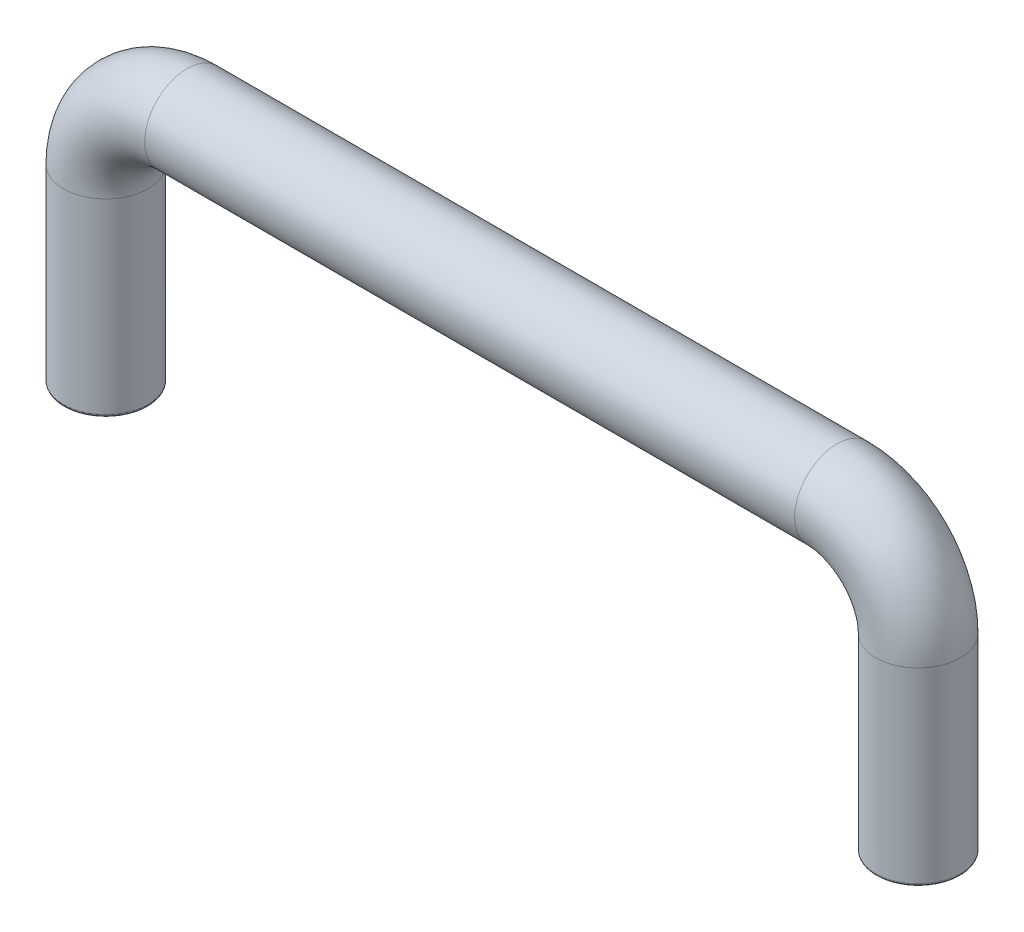
ISO-10303-21;
HEADER;
FILE_DESCRIPTION(('STEP AP214'),'2;1');
FILE_NAME('part.step','',(''),(''),'','','');
FILE_SCHEMA(('AUTOMOTIVE_DESIGN { 1 0 10303 214 1 1 1 1 }'));
ENDSEC;
DATA;
#1=APPLICATION_CONTEXT('core data for automotive mechanical design processes');
#2=APPLICATION_PROTOCOL_DEFINITION('international standard','automotive_design',2000,#1);
#3=PRODUCT_CONTEXT('',#1,'mechanical');
#4=PRODUCT('Part','Part','',(#3));
#5=PRODUCT_RELATED_PRODUCT_CATEGORY('part','',(#4));
#6=PRODUCT_DEFINITION_FORMATION('','',#4);
#7=PRODUCT_DEFINITION_CONTEXT('part definition',#1,'design');
#8=PRODUCT_DEFINITION('design','',#6,#7);
#9=PRODUCT_DEFINITION_SHAPE('','',#8);
#10=(LENGTH_UNIT() NAMED_UNIT(*) SI_UNIT(.MILLI.,.METRE.));
#11=(NAMED_UNIT(*) PLANE_ANGLE_UNIT() SI_UNIT($,.RADIAN.));
#12=(NAMED_UNIT(*) SI_UNIT($,.STERADIAN.) SOLID_ANGLE_UNIT());
#13=UNCERTAINTY_MEASURE_WITH_UNIT(LENGTH_MEASURE(1.E-05),#10,'distance_accuracy_value','');
#14=(GEOMETRIC_REPRESENTATION_CONTEXT(3) GLOBAL_UNCERTAINTY_ASSIGNED_CONTEXT((#13)) GLOBAL_UNIT_ASSIGNED_CONTEXT((#10,
#11,#12)) REPRESENTATION_CONTEXT('',''));
#15=CARTESIAN_POINT('',(0.,0.,0.));
#16=DIRECTION('',(0.,0.,1.));
#17=DIRECTION('',(1.,0.,0.));
#18=AXIS2_PLACEMENT_3D('',#15,#16,#17);
#19=CARTESIAN_POINT('',(76.2,0.,0.));
#20=DIRECTION('',(0.,1.,0.));
#21=DIRECTION('',(0.,0.,1.));
#22=AXIS2_PLACEMENT_3D('',#19,#20,#21);
#23=PLANE('',#22);
#24=CARTESIAN_POINT('',(76.2,0.,0.));
#25=DIRECTION('',(0.,1.,0.));
#26=DIRECTION('',(0.,0.,1.));
#27=AXIS2_PLACEMENT_3D('',#24,#25,#26);
#28=CIRCLE('',#27,1.98119999999999);
#29=CARTESIAN_POINT('',(76.2,0.,1.98119999999999));
#30=VERTEX_POINT('',#29);
#31=EDGE_CURVE('E92',#30,#30,#28,.T.);
#32=ORIENTED_EDGE('',*,*,#31,.T.);
#33=EDGE_LOOP('',(#32));
#34=FACE_BOUND('',#33,.T.);
#35=CARTESIAN_POINT('',(76.2,0.,0.));
#36=DIRECTION('',(0.,1.,0.));
#37=DIRECTION('',(0.,0.,1.));
#38=AXIS2_PLACEMENT_3D('',#35,#36,#37);
#39=CIRCLE('',#38,3.71475);
#40=CARTESIAN_POINT('',(76.2,0.,3.71475));
#41=VERTEX_POINT('',#40);
#42=EDGE_CURVE('E89',#41,#41,#39,.F.);
#43=ORIENTED_EDGE('',*,*,#42,.T.);
#44=EDGE_LOOP('',(#43));
#45=FACE_BOUND('',#44,.T.);
#46=ADVANCED_FACE('F36',(#34,#45),#23,.F.);
#47=CARTESIAN_POINT('',(0.,0.,0.));
#48=DIRECTION('',(0.,-1.,0.));
#49=DIRECTION('',(0.,0.,1.));
#50=AXIS2_PLACEMENT_3D('',#47,#48,#49);
#51=PLANE('',#50);
#52=CARTESIAN_POINT('',(0.,0.,0.));
#53=DIRECTION('',(0.,-1.,0.));
#54=DIRECTION('',(0.,0.,-1.));
#55=AXIS2_PLACEMENT_3D('',#52,#53,#54);
#56=CIRCLE('',#55,1.98119999999999);
#57=CARTESIAN_POINT('',(0.,0.,-1.98119999999999));
#58=VERTEX_POINT('',#57);
#59=EDGE_CURVE('E83',#58,#58,#56,.F.);
#60=ORIENTED_EDGE('',*,*,#59,.T.);
#61=EDGE_LOOP('',(#60));
#62=FACE_BOUND('',#61,.T.);
#63=CARTESIAN_POINT('',(0.,0.,0.));
#64=DIRECTION('',(0.,-1.,0.));
#65=DIRECTION('',(0.,0.,-1.));
#66=AXIS2_PLACEMENT_3D('',#63,#64,#65);
#67=CIRCLE('',#66,3.71475);
#68=CARTESIAN_POINT('',(0.,0.,-3.71475));
#69=VERTEX_POINT('',#68);
#70=EDGE_CURVE('E80',#69,#69,#67,.T.);
#71=ORIENTED_EDGE('',*,*,#70,.T.);
#72=EDGE_LOOP('',(#71));
#73=FACE_BOUND('',#72,.T.);
#74=ADVANCED_FACE('F114',(#62,#73),#51,.T.);
#75=CARTESIAN_POINT('',(0.,0.,0.));
#76=DIRECTION('',(0.,1.,0.));
#77=DIRECTION('',(0.,0.,1.));
#78=AXIS2_PLACEMENT_3D('',#75,#76,#77);
#79=CYLINDRICAL_SURFACE('',#78,3.96875);
#80=CARTESIAN_POINT('',(0.,0.254,0.));
#81=DIRECTION('',(0.,-1.,0.));
#82=DIRECTION('',(0.,0.,-1.));
#83=AXIS2_PLACEMENT_3D('',#80,#81,#82);
#84=CIRCLE('',#83,3.96875);
#85=CARTESIAN_POINT('',(0.,0.254,-3.96875));
#86=VERTEX_POINT('',#85);
#87=EDGE_CURVE('E11',#86,#86,#84,.F.);
#88=ORIENTED_EDGE('',*,*,#87,.T.);
#89=EDGE_LOOP('',(#88));
#90=FACE_BOUND('',#89,.T.);
#91=CARTESIAN_POINT('',(0.,17.78,0.));
#92=DIRECTION('',(0.,-1.,0.));
#93=DIRECTION('',(0.,0.,1.));
#94=AXIS2_PLACEMENT_3D('',#91,#92,#93);
#95=CIRCLE('',#94,3.96875);
#96=CARTESIAN_POINT('',(-3.96874999999996,17.78,0.));
#97=VERTEX_POINT('',#96);
#98=EDGE_CURVE('E63',#97,#97,#95,.T.);
#99=ORIENTED_EDGE('',*,*,#98,.T.);
#100=EDGE_LOOP('',(#99));
#101=FACE_BOUND('',#100,.T.);
#102=ADVANCED_FACE('F120',(#90,#101),#79,.T.);
#103=CARTESIAN_POINT('',(7.62,17.78,0.));
#104=DIRECTION('',(0.,0.,-1.));
#105=DIRECTION('',(-1.,0.,0.));
#106=AXIS2_PLACEMENT_3D('',#103,#104,#105);
#107=TOROIDAL_SURFACE('',#106,7.61999999999996,3.96875);
#108=CARTESIAN_POINT('',(7.62,25.4,0.));
#109=DIRECTION('',(-1.,0.,0.));
#110=DIRECTION('',(0.,0.,1.));
#111=AXIS2_PLACEMENT_3D('',#108,#109,#110);
#112=CIRCLE('',#111,3.96875);
#113=CARTESIAN_POINT('',(7.62,29.36875,0.));
#114=VERTEX_POINT('',#113);
#115=EDGE_CURVE('E68',#114,#114,#112,.T.);
#116=CARTESIAN_POINT('',(7.62,17.78,0.));
#117=DIRECTION('',(0.,0.,-1.));
#118=DIRECTION('',(-1.,0.,0.));
#119=AXIS2_PLACEMENT_3D('',#116,#117,#118);
#120=CIRCLE('',#119,11.58875);
#121=EDGE_CURVE('',#97,#114,#120,.T.);
#122=ORIENTED_EDGE('',*,*,#98,.F.);
#123=ORIENTED_EDGE('',*,*,#115,.T.);
#124=ORIENTED_EDGE('',*,*,#121,.T.);
#125=ORIENTED_EDGE('',*,*,#121,.F.);
#126=EDGE_LOOP('',(#122,#124,#123,#125));
#127=FACE_BOUND('',#126,.T.);
#128=ADVANCED_FACE('F139',(#127),#107,.T.);
#129=CARTESIAN_POINT('',(7.62,25.4,0.));
#130=DIRECTION('',(1.,0.,0.));
#131=DIRECTION('',(0.,1.,0.));
#132=AXIS2_PLACEMENT_3D('',#129,#130,#131);
#133=CYLINDRICAL_SURFACE('',#132,3.96875);
#134=CARTESIAN_POINT('',(68.58,25.4,0.));
#135=DIRECTION('',(-1.,0.,0.));
#136=DIRECTION('',(0.,0.,1.));
#137=AXIS2_PLACEMENT_3D('',#134,#135,#136);
#138=CIRCLE('',#137,3.96875);
#139=CARTESIAN_POINT('',(68.58,29.36875,0.));
#140=VERTEX_POINT('',#139);
#141=EDGE_CURVE('E71',#140,#140,#138,.T.);
#142=ORIENTED_EDGE('',*,*,#141,.T.);
#143=EDGE_LOOP('',(#142));
#144=FACE_BOUND('',#143,.T.);
#145=ORIENTED_EDGE('',*,*,#115,.F.);
#146=EDGE_LOOP('',(#145));
#147=FACE_BOUND('',#146,.T.);
#148=ADVANCED_FACE('F133',(#144,#147),#133,.T.);
#149=CARTESIAN_POINT('',(68.58,17.78,0.));
#150=DIRECTION('',(0.,0.,-1.));
#151=DIRECTION('',(-1.,0.,0.));
#152=AXIS2_PLACEMENT_3D('',#149,#150,#151);
#153=TOROIDAL_SURFACE('',#152,7.61999999999996,3.96875);
#154=CARTESIAN_POINT('',(76.2,17.78,0.));
#155=DIRECTION('',(0.,1.,0.));
#156=DIRECTION('',(0.,0.,1.));
#157=AXIS2_PLACEMENT_3D('',#154,#155,#156);
#158=CIRCLE('',#157,3.96875);
#159=CARTESIAN_POINT('',(80.16875,17.78,0.));
#160=VERTEX_POINT('',#159);
#161=EDGE_CURVE('E74',#160,#160,#158,.T.);
#162=CARTESIAN_POINT('',(68.58,17.78,0.));
#163=DIRECTION('',(0.,0.,-1.));
#164=DIRECTION('',(-1.,0.,0.));
#165=AXIS2_PLACEMENT_3D('',#162,#163,#164);
#166=CIRCLE('',#165,11.58875);
#167=EDGE_CURVE('',#140,#160,#166,.T.);
#168=ORIENTED_EDGE('',*,*,#141,.F.);
#169=ORIENTED_EDGE('',*,*,#161,.T.);
#170=ORIENTED_EDGE('',*,*,#167,.T.);
#171=ORIENTED_EDGE('',*,*,#167,.F.);
#172=EDGE_LOOP('',(#168,#170,#169,#171));
#173=FACE_BOUND('',#172,.T.);
#174=ADVANCED_FACE('F127',(#173),#153,.T.);
#175=CARTESIAN_POINT('',(76.2,17.78,0.));
#176=DIRECTION('',(0.,-1.,0.));
#177=DIRECTION('',(0.,0.,-1.));
#178=AXIS2_PLACEMENT_3D('',#175,#176,#177);
#179=CYLINDRICAL_SURFACE('',#178,3.96875);
#180=CARTESIAN_POINT('',(76.2,0.254000000000001,0.));
#181=DIRECTION('',(0.,1.,0.));
#182=DIRECTION('',(0.,0.,1.));
#183=AXIS2_PLACEMENT_3D('',#180,#181,#182);
#184=CIRCLE('',#183,3.96875);
#185=CARTESIAN_POINT('',(76.2,0.254000000000001,3.96875));
#186=VERTEX_POINT('',#185);
#187=EDGE_CURVE('E44',#186,#186,#184,.T.);
#188=ORIENTED_EDGE('',*,*,#187,.T.);
#189=EDGE_LOOP('',(#188));
#190=FACE_BOUND('',#189,.T.);
#191=ORIENTED_EDGE('',*,*,#161,.F.);
#192=EDGE_LOOP('',(#191));
#193=FACE_BOUND('',#192,.T.);
#194=ADVANCED_FACE('F97',(#190,#193),#179,.T.);
#195=CARTESIAN_POINT('',(0.,7.96924999999996,0.));
#196=DIRECTION('',(0.,-1.,0.));
#197=DIRECTION('',(0.,0.,-1.));
#198=AXIS2_PLACEMENT_3D('',#195,#196,#197);
#199=CONICAL_SURFACE('',#198,1.7272,1.02974425867665);
#200=CARTESIAN_POINT('',(0.,9.00705646118436,0.));
#201=VERTEX_POINT('',#200);
#202=VERTEX_LOOP('',#201);
#203=FACE_BOUND('',#202,.T.);
#204=CARTESIAN_POINT('',(0.,7.96924999999996,0.));
#205=DIRECTION('',(0.,-1.,0.));
#206=DIRECTION('',(0.,0.,-1.));
#207=AXIS2_PLACEMENT_3D('',#204,#205,#206);
#208=CIRCLE('',#207,1.7272);
#209=CARTESIAN_POINT('',(0.,7.96924999999996,-1.7272));
#210=VERTEX_POINT('',#209);
#211=EDGE_CURVE('E60',#210,#210,#208,.T.);
#212=ORIENTED_EDGE('',*,*,#211,.T.);
#213=EDGE_LOOP('',(#212));
#214=FACE_BOUND('',#213,.T.);
#215=ADVANCED_FACE('F123',(#203,#214),#199,.F.);
#216=CARTESIAN_POINT('',(0.,0.,0.));
#217=DIRECTION('',(0.,-1.,0.));
#218=DIRECTION('',(0.,0.,-1.));
#219=AXIS2_PLACEMENT_3D('',#216,#217,#218);
#220=CYLINDRICAL_SURFACE('',#219,1.72719999999999);
#221=CARTESIAN_POINT('',(0.,0.254,0.));
#222=DIRECTION('',(0.,-1.,0.));
#223=DIRECTION('',(0.,0.,-1.));
#224=AXIS2_PLACEMENT_3D('',#221,#222,#223);
#225=CIRCLE('',#224,1.72719999999999);
#226=CARTESIAN_POINT('',(0.,0.254,-1.72719999999999));
#227=VERTEX_POINT('',#226);
#228=EDGE_CURVE('E77',#227,#227,#225,.T.);
#229=ORIENTED_EDGE('',*,*,#228,.T.);
#230=EDGE_LOOP('',(#229));
#231=FACE_BOUND('',#230,.T.);
#232=ORIENTED_EDGE('',*,*,#211,.F.);
#233=EDGE_LOOP('',(#232));
#234=FACE_BOUND('',#233,.T.);
#235=ADVANCED_FACE('F54',(#231,#234),#220,.F.);
#236=CARTESIAN_POINT('',(76.2,7.96924999999996,0.));
#237=DIRECTION('',(0.,-1.,0.));
#238=DIRECTION('',(0.,0.,-1.));
#239=AXIS2_PLACEMENT_3D('',#236,#237,#238);
#240=CONICAL_SURFACE('',#239,1.7272,1.02974425867665);
#241=CARTESIAN_POINT('',(76.2,9.00705646118436,0.));
#242=VERTEX_POINT('',#241);
#243=VERTEX_LOOP('',#242);
#244=FACE_BOUND('',#243,.T.);
#245=CARTESIAN_POINT('',(76.2,7.96924999999996,0.));
#246=DIRECTION('',(0.,-1.,0.));
#247=DIRECTION('',(0.,0.,-1.));
#248=AXIS2_PLACEMENT_3D('',#245,#246,#247);
#249=CIRCLE('',#248,1.7272);
#250=CARTESIAN_POINT('',(76.2,7.96924999999996,-1.7272));
#251=VERTEX_POINT('',#250);
#252=EDGE_CURVE('E58',#251,#251,#249,.T.);
#253=ORIENTED_EDGE('',*,*,#252,.T.);
#254=EDGE_LOOP('',(#253));
#255=FACE_BOUND('',#254,.T.);
#256=ADVANCED_FACE('F50',(#244,#255),#240,.F.);
#257=CARTESIAN_POINT('',(76.2,0.,0.));
#258=DIRECTION('',(0.,-1.,0.));
#259=DIRECTION('',(0.,0.,-1.));
#260=AXIS2_PLACEMENT_3D('',#257,#258,#259);
#261=CYLINDRICAL_SURFACE('',#260,1.72719999999999);
#262=CARTESIAN_POINT('',(76.2,0.254,0.));
#263=DIRECTION('',(0.,1.,0.));
#264=DIRECTION('',(0.,0.,1.));
#265=AXIS2_PLACEMENT_3D('',#262,#263,#264);
#266=CIRCLE('',#265,1.72719999999999);
#267=CARTESIAN_POINT('',(76.2,0.254,1.72719999999999));
#268=VERTEX_POINT('',#267);
#269=EDGE_CURVE('E86',#268,#268,#266,.F.);
#270=ORIENTED_EDGE('',*,*,#269,.T.);
#271=EDGE_LOOP('',(#270));
#272=FACE_BOUND('',#271,.T.);
#273=ORIENTED_EDGE('',*,*,#252,.F.);
#274=EDGE_LOOP('',(#273));
#275=FACE_BOUND('',#274,.T.);
#276=ADVANCED_FACE('F53',(#272,#275),#261,.F.);
#277=CARTESIAN_POINT('',(0.,0.254,0.));
#278=DIRECTION('',(0.,-1.,0.));
#279=DIRECTION('',(0.,0.,-1.));
#280=AXIS2_PLACEMENT_3D('',#277,#278,#279);
#281=TOROIDAL_SURFACE('',#280,1.98119999999999,0.254);
#282=ORIENTED_EDGE('',*,*,#59,.F.);
#283=EDGE_LOOP('',(#282));
#284=FACE_BOUND('',#283,.T.);
#285=ORIENTED_EDGE('',*,*,#228,.F.);
#286=EDGE_LOOP('',(#285));
#287=FACE_BOUND('',#286,.T.);
#288=ADVANCED_FACE('F109',(#284,#287),#281,.T.);
#289=CARTESIAN_POINT('',(76.2,0.254,0.));
#290=DIRECTION('',(0.,1.,0.));
#291=DIRECTION('',(0.,0.,1.));
#292=AXIS2_PLACEMENT_3D('',#289,#290,#291);
#293=TOROIDAL_SURFACE('',#292,1.98119999999999,0.254);
#294=ORIENTED_EDGE('',*,*,#31,.F.);
#295=EDGE_LOOP('',(#294));
#296=FACE_BOUND('',#295,.T.);
#297=ORIENTED_EDGE('',*,*,#269,.F.);
#298=EDGE_LOOP('',(#297));
#299=FACE_BOUND('',#298,.T.);
#300=ADVANCED_FACE('F102',(#296,#299),#293,.T.);
#301=CARTESIAN_POINT('',(76.2,0.254000000000001,0.));
#302=DIRECTION('',(0.,1.,0.));
#303=DIRECTION('',(0.,0.,1.));
#304=AXIS2_PLACEMENT_3D('',#301,#302,#303);
#305=TOROIDAL_SURFACE('',#304,3.71475,0.254);
#306=ORIENTED_EDGE('',*,*,#42,.F.);
#307=EDGE_LOOP('',(#306));
#308=FACE_BOUND('',#307,.T.);
#309=ORIENTED_EDGE('',*,*,#187,.F.);
#310=EDGE_LOOP('',(#309));
#311=FACE_BOUND('',#310,.T.);
#312=ADVANCED_FACE('F100',(#308,#311),#305,.T.);
#313=CARTESIAN_POINT('',(0.,0.254,0.));
#314=DIRECTION('',(0.,-1.,0.));
#315=DIRECTION('',(0.,0.,-1.));
#316=AXIS2_PLACEMENT_3D('',#313,#314,#315);
#317=TOROIDAL_SURFACE('',#316,3.71475,0.254);
#318=ORIENTED_EDGE('',*,*,#87,.F.);
#319=EDGE_LOOP('',(#318));
#320=FACE_BOUND('',#319,.T.);
#321=ORIENTED_EDGE('',*,*,#70,.F.);
#322=EDGE_LOOP('',(#321));
#323=FACE_BOUND('',#322,.T.);
#324=ADVANCED_FACE('F38',(#320,#323),#317,.T.);
#325=CLOSED_SHELL('',(#46,#74,#102,#128,#148,#174,#194,#215,#235,#256,#276,#288,#300,#312,#324));
#326=MANIFOLD_SOLID_BREP('B2',#325);
#327=ADVANCED_BREP_SHAPE_REPRESENTATION('',(#18,#326),#14);
#328=SHAPE_DEFINITION_REPRESENTATION(#9,#327);
ENDSEC;
END-ISO-10303-21;
